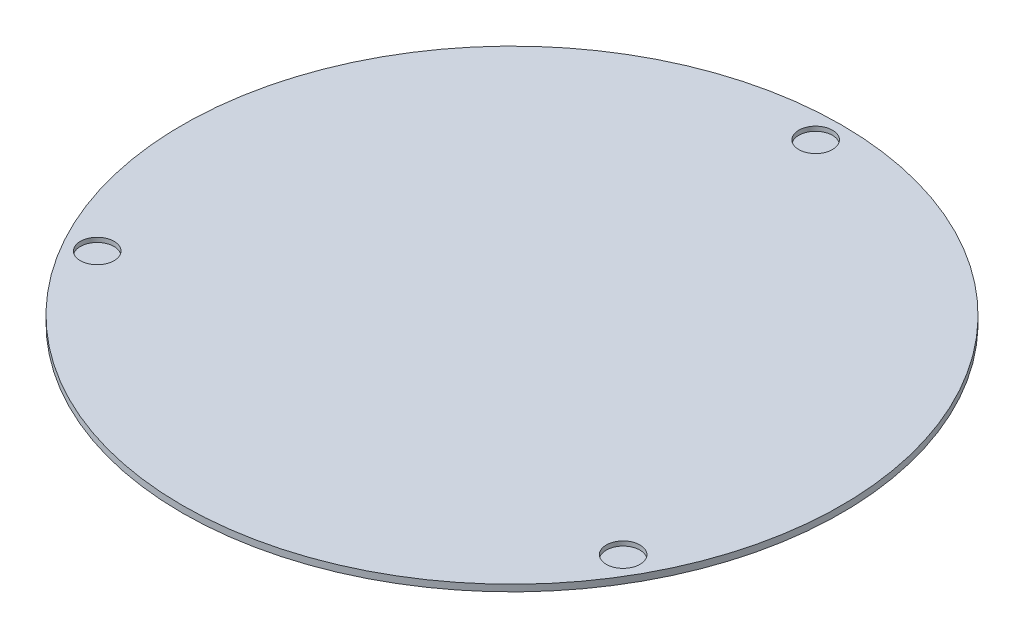
ISO-10303-21;
HEADER;
FILE_DESCRIPTION(('STEP AP214'),'2;1');
FILE_NAME('part.step','',(''),(''),'','','');
FILE_SCHEMA(('AUTOMOTIVE_DESIGN { 1 0 10303 214 1 1 1 1 }'));
ENDSEC;
DATA;
#1=APPLICATION_CONTEXT('core data for automotive mechanical design processes');
#2=APPLICATION_PROTOCOL_DEFINITION('international standard','automotive_design',2000,#1);
#3=PRODUCT_CONTEXT('',#1,'mechanical');
#4=PRODUCT('Part','Part','',(#3));
#5=PRODUCT_RELATED_PRODUCT_CATEGORY('part','',(#4));
#6=PRODUCT_DEFINITION_FORMATION('','',#4);
#7=PRODUCT_DEFINITION_CONTEXT('part definition',#1,'design');
#8=PRODUCT_DEFINITION('design','',#6,#7);
#9=PRODUCT_DEFINITION_SHAPE('','',#8);
#10=(LENGTH_UNIT() NAMED_UNIT(*) SI_UNIT(.MILLI.,.METRE.));
#11=(NAMED_UNIT(*) PLANE_ANGLE_UNIT() SI_UNIT($,.RADIAN.));
#12=(NAMED_UNIT(*) SI_UNIT($,.STERADIAN.) SOLID_ANGLE_UNIT());
#13=UNCERTAINTY_MEASURE_WITH_UNIT(LENGTH_MEASURE(1.E-05),#10,'distance_accuracy_value','');
#14=(GEOMETRIC_REPRESENTATION_CONTEXT(3) GLOBAL_UNCERTAINTY_ASSIGNED_CONTEXT((#13)) GLOBAL_UNIT_ASSIGNED_CONTEXT((#10,
#11,#12)) REPRESENTATION_CONTEXT('',''));
#15=CARTESIAN_POINT('',(0.,0.,0.));
#16=DIRECTION('',(0.,0.,1.));
#17=DIRECTION('',(1.,0.,0.));
#18=AXIS2_PLACEMENT_3D('',#15,#16,#17);
#19=CARTESIAN_POINT('',(0.,3.,0.));
#20=DIRECTION('',(0.,-1.,0.));
#21=DIRECTION('',(0.,0.,-1.));
#22=AXIS2_PLACEMENT_3D('',#19,#20,#21);
#23=CYLINDRICAL_SURFACE('',#22,149.225);
#24=CARTESIAN_POINT('',(0.,3.,0.));
#25=DIRECTION('',(0.,1.,0.));
#26=DIRECTION('',(0.,0.,1.));
#27=AXIS2_PLACEMENT_3D('',#24,#25,#26);
#28=CIRCLE('',#27,149.225);
#29=CARTESIAN_POINT('',(0.,3.,149.225));
#30=VERTEX_POINT('',#29);
#31=EDGE_CURVE('E10',#30,#30,#28,.T.);
#32=ORIENTED_EDGE('',*,*,#31,.F.);
#33=EDGE_LOOP('',(#32));
#34=FACE_BOUND('',#33,.T.);
#35=CARTESIAN_POINT('',(0.,0.,0.));
#36=DIRECTION('',(0.,1.,0.));
#37=DIRECTION('',(0.,0.,1.));
#38=AXIS2_PLACEMENT_3D('',#35,#36,#37);
#39=CIRCLE('',#38,149.225);
#40=CARTESIAN_POINT('',(0.,0.,149.225));
#41=VERTEX_POINT('',#40);
#42=EDGE_CURVE('E36',#41,#41,#39,.T.);
#43=ORIENTED_EDGE('',*,*,#42,.T.);
#44=EDGE_LOOP('',(#43));
#45=FACE_BOUND('',#44,.T.);
#46=ADVANCED_FACE('F33',(#34,#45),#23,.T.);
#47=CARTESIAN_POINT('',(0.,3.,0.));
#48=DIRECTION('',(0.,1.,0.));
#49=DIRECTION('',(0.,0.,1.));
#50=AXIS2_PLACEMENT_3D('',#47,#48,#49);
#51=PLANE('',#50);
#52=CARTESIAN_POINT('',(-119.070005971397,3.,68.7451000000034));
#53=DIRECTION('',(0.,1.,0.));
#54=DIRECTION('',(0.,0.,1.));
#55=AXIS2_PLACEMENT_3D('',#52,#53,#54);
#56=CIRCLE('',#55,7.62000000000784);
#57=CARTESIAN_POINT('',(-119.070005971397,3.,76.3651000000113));
#58=VERTEX_POINT('',#57);
#59=EDGE_CURVE('E59',#58,#58,#56,.T.);
#60=ORIENTED_EDGE('',*,*,#59,.F.);
#61=EDGE_LOOP('',(#60));
#62=FACE_BOUND('',#61,.T.);
#63=CARTESIAN_POINT('',(119.070005971409,3.,68.7450999999966));
#64=DIRECTION('',(0.,1.,0.));
#65=DIRECTION('',(0.,0.,1.));
#66=AXIS2_PLACEMENT_3D('',#63,#64,#65);
#67=CIRCLE('',#66,7.62000000000523);
#68=CARTESIAN_POINT('',(119.070005971409,3.,76.3651000000018));
#69=VERTEX_POINT('',#68);
#70=EDGE_CURVE('E52',#69,#69,#67,.T.);
#71=ORIENTED_EDGE('',*,*,#70,.F.);
#72=EDGE_LOOP('',(#71));
#73=FACE_BOUND('',#72,.T.);
#74=CARTESIAN_POINT('',(0.,3.,-137.4902));
#75=DIRECTION('',(0.,1.,0.));
#76=DIRECTION('',(0.,0.,1.));
#77=AXIS2_PLACEMENT_3D('',#74,#75,#76);
#78=CIRCLE('',#77,7.62);
#79=CARTESIAN_POINT('',(0.,3.,-129.8702));
#80=VERTEX_POINT('',#79);
#81=EDGE_CURVE('E45',#80,#80,#78,.T.);
#82=ORIENTED_EDGE('',*,*,#81,.F.);
#83=EDGE_LOOP('',(#82));
#84=FACE_BOUND('',#83,.T.);
#85=ORIENTED_EDGE('',*,*,#31,.T.);
#86=EDGE_LOOP('',(#85));
#87=FACE_BOUND('',#86,.T.);
#88=ADVANCED_FACE('F75',(#62,#73,#84,#87),#51,.T.);
#89=CARTESIAN_POINT('',(0.,0.,0.));
#90=DIRECTION('',(0.,1.,0.));
#91=DIRECTION('',(0.,0.,1.));
#92=AXIS2_PLACEMENT_3D('',#89,#90,#91);
#93=PLANE('',#92);
#94=ORIENTED_EDGE('',*,*,#42,.F.);
#95=EDGE_LOOP('',(#94));
#96=FACE_BOUND('',#95,.T.);
#97=ADVANCED_FACE('F78',(#96),#93,.F.);
#98=CARTESIAN_POINT('',(0.,0.968,-137.4902));
#99=DIRECTION('',(0.,1.,0.));
#100=DIRECTION('',(0.,0.,1.));
#101=AXIS2_PLACEMENT_3D('',#98,#99,#100);
#102=CYLINDRICAL_SURFACE('',#101,7.62);
#103=CARTESIAN_POINT('',(0.,0.968,-137.4902));
#104=DIRECTION('',(0.,1.,0.));
#105=DIRECTION('',(0.,0.,1.));
#106=AXIS2_PLACEMENT_3D('',#103,#104,#105);
#107=CIRCLE('',#106,7.62);
#108=CARTESIAN_POINT('',(0.,0.968,-129.8702));
#109=VERTEX_POINT('',#108);
#110=EDGE_CURVE('E43',#109,#109,#107,.T.);
#111=ORIENTED_EDGE('',*,*,#110,.F.);
#112=EDGE_LOOP('',(#111));
#113=FACE_BOUND('',#112,.T.);
#114=ORIENTED_EDGE('',*,*,#81,.T.);
#115=EDGE_LOOP('',(#114));
#116=FACE_BOUND('',#115,.T.);
#117=ADVANCED_FACE('F84',(#113,#116),#102,.F.);
#118=CARTESIAN_POINT('',(0.,0.968,-137.4902));
#119=DIRECTION('',(0.,1.,0.));
#120=DIRECTION('',(0.,0.,1.));
#121=AXIS2_PLACEMENT_3D('',#118,#119,#120);
#122=PLANE('',#121);
#123=ORIENTED_EDGE('',*,*,#110,.T.);
#124=EDGE_LOOP('',(#123));
#125=FACE_BOUND('',#124,.T.);
#126=ADVANCED_FACE('F86',(#125),#122,.T.);
#127=CARTESIAN_POINT('',(119.070005971409,0.968,68.7450999999966));
#128=DIRECTION('',(0.,1.,0.));
#129=DIRECTION('',(0.,0.,1.));
#130=AXIS2_PLACEMENT_3D('',#127,#128,#129);
#131=CYLINDRICAL_SURFACE('',#130,7.62000000000523);
#132=CARTESIAN_POINT('',(119.070005971409,0.968,68.7450999999966));
#133=DIRECTION('',(0.,1.,0.));
#134=DIRECTION('',(0.,0.,1.));
#135=AXIS2_PLACEMENT_3D('',#132,#133,#134);
#136=CIRCLE('',#135,7.62000000000523);
#137=CARTESIAN_POINT('',(119.070005971409,0.968,76.3651000000018));
#138=VERTEX_POINT('',#137);
#139=EDGE_CURVE('E49',#138,#138,#136,.T.);
#140=ORIENTED_EDGE('',*,*,#139,.F.);
#141=EDGE_LOOP('',(#140));
#142=FACE_BOUND('',#141,.T.);
#143=ORIENTED_EDGE('',*,*,#70,.T.);
#144=EDGE_LOOP('',(#143));
#145=FACE_BOUND('',#144,.T.);
#146=ADVANCED_FACE('F93',(#142,#145),#131,.F.);
#147=CARTESIAN_POINT('',(119.070005971409,0.968,68.7450999999966));
#148=DIRECTION('',(0.,1.,0.));
#149=DIRECTION('',(0.,0.,1.));
#150=AXIS2_PLACEMENT_3D('',#147,#148,#149);
#151=PLANE('',#150);
#152=ORIENTED_EDGE('',*,*,#139,.T.);
#153=EDGE_LOOP('',(#152));
#154=FACE_BOUND('',#153,.T.);
#155=ADVANCED_FACE('F71',(#154),#151,.T.);
#156=CARTESIAN_POINT('',(-119.070005971397,0.968,68.7451000000034));
#157=DIRECTION('',(0.,1.,0.));
#158=DIRECTION('',(0.,0.,1.));
#159=AXIS2_PLACEMENT_3D('',#156,#157,#158);
#160=CYLINDRICAL_SURFACE('',#159,7.62000000000784);
#161=CARTESIAN_POINT('',(-119.070005971397,0.968,68.7451000000034));
#162=DIRECTION('',(0.,1.,0.));
#163=DIRECTION('',(0.,0.,1.));
#164=AXIS2_PLACEMENT_3D('',#161,#162,#163);
#165=CIRCLE('',#164,7.62000000000784);
#166=CARTESIAN_POINT('',(-119.070005971397,0.968,76.3651000000113));
#167=VERTEX_POINT('',#166);
#168=EDGE_CURVE('E56',#167,#167,#165,.T.);
#169=ORIENTED_EDGE('',*,*,#168,.F.);
#170=EDGE_LOOP('',(#169));
#171=FACE_BOUND('',#170,.T.);
#172=ORIENTED_EDGE('',*,*,#59,.T.);
#173=EDGE_LOOP('',(#172));
#174=FACE_BOUND('',#173,.T.);
#175=ADVANCED_FACE('F68',(#171,#174),#160,.F.);
#176=CARTESIAN_POINT('',(-119.070005971397,0.968,68.7451000000034));
#177=DIRECTION('',(0.,1.,0.));
#178=DIRECTION('',(0.,0.,1.));
#179=AXIS2_PLACEMENT_3D('',#176,#177,#178);
#180=PLANE('',#179);
#181=ORIENTED_EDGE('',*,*,#168,.T.);
#182=EDGE_LOOP('',(#181));
#183=FACE_BOUND('',#182,.T.);
#184=ADVANCED_FACE('F66',(#183),#180,.T.);
#185=CLOSED_SHELL('',(#46,#88,#97,#117,#126,#146,#155,#175,#184));
#186=MANIFOLD_SOLID_BREP('B2',#185);
#187=ADVANCED_BREP_SHAPE_REPRESENTATION('',(#18,#186),#14);
#188=SHAPE_DEFINITION_REPRESENTATION(#9,#187);
ENDSEC;
END-ISO-10303-21;
